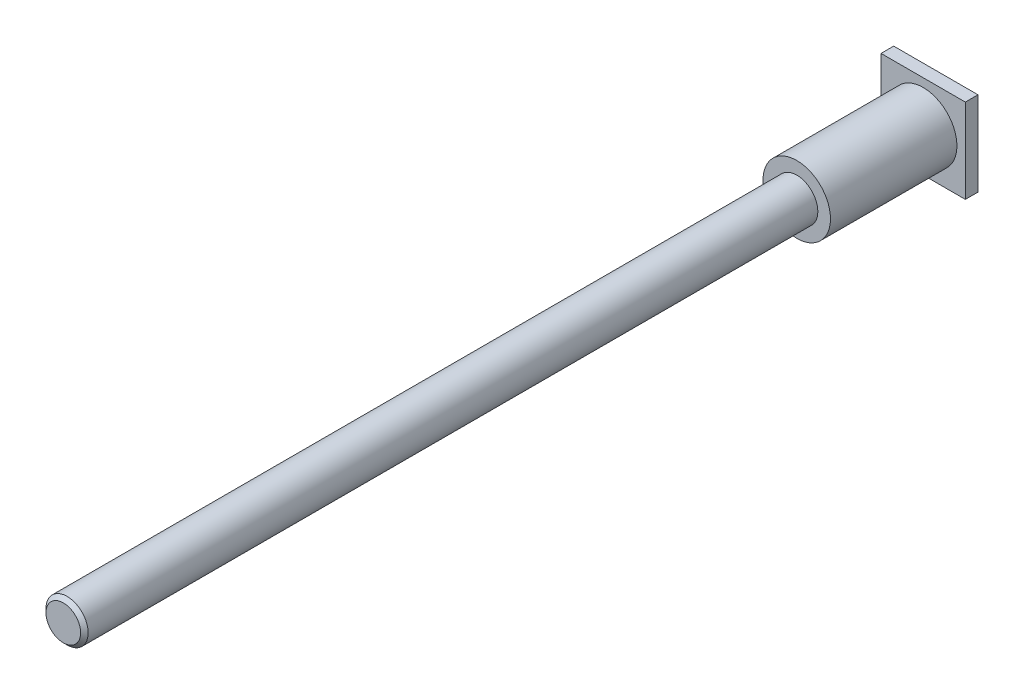
ISO-10303-21;
HEADER;
FILE_DESCRIPTION(('STEP AP214'),'2;1');
FILE_NAME('part.step','',(''),(''),'','','');
FILE_SCHEMA(('AUTOMOTIVE_DESIGN { 1 0 10303 214 1 1 1 1 }'));
ENDSEC;
DATA;
#1=APPLICATION_CONTEXT('core data for automotive mechanical design processes');
#2=APPLICATION_PROTOCOL_DEFINITION('international standard','automotive_design',2000,#1);
#3=PRODUCT_CONTEXT('',#1,'mechanical');
#4=PRODUCT('Part','Part','',(#3));
#5=PRODUCT_RELATED_PRODUCT_CATEGORY('part','',(#4));
#6=PRODUCT_DEFINITION_FORMATION('','',#4);
#7=PRODUCT_DEFINITION_CONTEXT('part definition',#1,'design');
#8=PRODUCT_DEFINITION('design','',#6,#7);
#9=PRODUCT_DEFINITION_SHAPE('','',#8);
#10=(LENGTH_UNIT() NAMED_UNIT(*) SI_UNIT(.MILLI.,.METRE.));
#11=(NAMED_UNIT(*) PLANE_ANGLE_UNIT() SI_UNIT($,.RADIAN.));
#12=(NAMED_UNIT(*) SI_UNIT($,.STERADIAN.) SOLID_ANGLE_UNIT());
#13=UNCERTAINTY_MEASURE_WITH_UNIT(LENGTH_MEASURE(1.E-05),#10,'distance_accuracy_value','');
#14=(GEOMETRIC_REPRESENTATION_CONTEXT(3) GLOBAL_UNCERTAINTY_ASSIGNED_CONTEXT((#13)) GLOBAL_UNIT_ASSIGNED_CONTEXT((#10,
#11,#12)) REPRESENTATION_CONTEXT('',''));
#15=CARTESIAN_POINT('',(0.,0.,0.));
#16=DIRECTION('',(0.,0.,1.));
#17=DIRECTION('',(1.,0.,0.));
#18=AXIS2_PLACEMENT_3D('',#15,#16,#17);
#19=CARTESIAN_POINT('',(0.,0.,102.));
#20=DIRECTION('',(0.,0.,-1.));
#21=DIRECTION('',(-1.,0.,0.));
#22=AXIS2_PLACEMENT_3D('',#19,#20,#21);
#23=CYLINDRICAL_SURFACE('',#22,4.);
#24=CARTESIAN_POINT('',(0.,0.,0.));
#25=DIRECTION('',(0.,0.,-1.));
#26=DIRECTION('',(-1.,0.,0.));
#27=AXIS2_PLACEMENT_3D('',#24,#25,#26);
#28=CIRCLE('',#27,4.);
#29=CARTESIAN_POINT('',(-4.,0.,0.));
#30=VERTEX_POINT('',#29);
#31=EDGE_CURVE('E129',#30,#30,#28,.T.);
#32=ORIENTED_EDGE('',*,*,#31,.F.);
#33=EDGE_LOOP('',(#32));
#34=FACE_BOUND('',#33,.T.);
#35=CARTESIAN_POINT('',(0.,0.,15.));
#36=DIRECTION('',(0.,0.,1.));
#37=DIRECTION('',(1.,0.,0.));
#38=AXIS2_PLACEMENT_3D('',#35,#36,#37);
#39=CIRCLE('',#38,4.);
#40=CARTESIAN_POINT('',(4.,0.,15.));
#41=VERTEX_POINT('',#40);
#42=EDGE_CURVE('E102',#41,#41,#39,.T.);
#43=ORIENTED_EDGE('',*,*,#42,.F.);
#44=EDGE_LOOP('',(#43));
#45=FACE_BOUND('',#44,.T.);
#46=ADVANCED_FACE('F38',(#34,#45),#23,.T.);
#47=CARTESIAN_POINT('',(0.,0.,0.));
#48=DIRECTION('',(0.,0.,-1.));
#49=DIRECTION('',(-1.,0.,0.));
#50=AXIS2_PLACEMENT_3D('',#47,#48,#49);
#51=PLANE('',#50);
#52=DIRECTION('',(0.,-1.,0.));
#53=VECTOR('',#52,1.);
#54=CARTESIAN_POINT('',(5.,-5.,0.));
#55=LINE('',#54,#53);
#56=CARTESIAN_POINT('',(5.,5.,0.));
#57=VERTEX_POINT('',#56);
#58=CARTESIAN_POINT('',(5.,-5.,0.));
#59=VERTEX_POINT('',#58);
#60=EDGE_CURVE('E101',#57,#59,#55,.T.);
#61=ORIENTED_EDGE('',*,*,#60,.F.);
#62=DIRECTION('',(1.,0.,0.));
#63=VECTOR('',#62,1.);
#64=CARTESIAN_POINT('',(-5.,5.,0.));
#65=LINE('',#64,#63);
#66=CARTESIAN_POINT('',(-5.,5.,0.));
#67=VERTEX_POINT('',#66);
#68=EDGE_CURVE('E79',#67,#57,#65,.T.);
#69=ORIENTED_EDGE('',*,*,#68,.F.);
#70=DIRECTION('',(0.,1.,0.));
#71=VECTOR('',#70,1.);
#72=CARTESIAN_POINT('',(-5.,-5.,0.));
#73=LINE('',#72,#71);
#74=CARTESIAN_POINT('',(-5.,-5.,0.));
#75=VERTEX_POINT('',#74);
#76=EDGE_CURVE('E73',#75,#67,#73,.T.);
#77=ORIENTED_EDGE('',*,*,#76,.F.);
#78=DIRECTION('',(-1.,0.,0.));
#79=VECTOR('',#78,1.);
#80=CARTESIAN_POINT('',(-5.,-5.,0.));
#81=LINE('',#80,#79);
#82=EDGE_CURVE('E105',#59,#75,#81,.T.);
#83=ORIENTED_EDGE('',*,*,#82,.F.);
#84=EDGE_LOOP('',(#61,#69,#77,#83));
#85=FACE_BOUND('',#84,.T.);
#86=ORIENTED_EDGE('',*,*,#31,.T.);
#87=EDGE_LOOP('',(#86));
#88=FACE_BOUND('',#87,.T.);
#89=ADVANCED_FACE('F151',(#85,#88),#51,.F.);
#90=CARTESIAN_POINT('',(5.,-5.,-1.5));
#91=DIRECTION('',(-1.,0.,0.));
#92=DIRECTION('',(0.,0.,1.));
#93=AXIS2_PLACEMENT_3D('',#90,#91,#92);
#94=PLANE('',#93);
#95=ORIENTED_EDGE('',*,*,#60,.T.);
#96=DIRECTION('',(0.,0.,1.));
#97=VECTOR('',#96,1.);
#98=CARTESIAN_POINT('',(5.,-5.,-1.5));
#99=LINE('',#98,#97);
#100=CARTESIAN_POINT('',(5.,-5.,-1.5));
#101=VERTEX_POINT('',#100);
#102=EDGE_CURVE('E127',#101,#59,#99,.T.);
#103=ORIENTED_EDGE('',*,*,#102,.F.);
#104=DIRECTION('',(0.,-1.,0.));
#105=VECTOR('',#104,1.);
#106=CARTESIAN_POINT('',(5.,-5.,-1.5));
#107=LINE('',#106,#105);
#108=CARTESIAN_POINT('',(5.,5.,-1.5));
#109=VERTEX_POINT('',#108);
#110=EDGE_CURVE('E112',#109,#101,#107,.T.);
#111=ORIENTED_EDGE('',*,*,#110,.F.);
#112=DIRECTION('',(0.,0.,1.));
#113=VECTOR('',#112,1.);
#114=CARTESIAN_POINT('',(5.,5.,-1.5));
#115=LINE('',#114,#113);
#116=EDGE_CURVE('E117',#109,#57,#115,.T.);
#117=ORIENTED_EDGE('',*,*,#116,.T.);
#118=EDGE_LOOP('',(#95,#103,#111,#117));
#119=FACE_BOUND('',#118,.T.);
#120=ADVANCED_FACE('F157',(#119),#94,.F.);
#121=CARTESIAN_POINT('',(-5.,-5.,-1.5));
#122=DIRECTION('',(0.,1.,0.));
#123=DIRECTION('',(-1.,0.,0.));
#124=AXIS2_PLACEMENT_3D('',#121,#122,#123);
#125=PLANE('',#124);
#126=ORIENTED_EDGE('',*,*,#82,.T.);
#127=DIRECTION('',(0.,0.,1.));
#128=VECTOR('',#127,1.);
#129=CARTESIAN_POINT('',(-5.,-5.,-1.5));
#130=LINE('',#129,#128);
#131=CARTESIAN_POINT('',(-5.,-5.,-1.5));
#132=VERTEX_POINT('',#131);
#133=EDGE_CURVE('E125',#132,#75,#130,.T.);
#134=ORIENTED_EDGE('',*,*,#133,.F.);
#135=DIRECTION('',(-1.,0.,0.));
#136=VECTOR('',#135,1.);
#137=CARTESIAN_POINT('',(-5.,-5.,-1.5));
#138=LINE('',#137,#136);
#139=EDGE_CURVE('E87',#101,#132,#138,.T.);
#140=ORIENTED_EDGE('',*,*,#139,.F.);
#141=ORIENTED_EDGE('',*,*,#102,.T.);
#142=EDGE_LOOP('',(#126,#134,#140,#141));
#143=FACE_BOUND('',#142,.T.);
#144=ADVANCED_FACE('F190',(#143),#125,.F.);
#145=CARTESIAN_POINT('',(-5.,-5.,-1.5));
#146=DIRECTION('',(1.,0.,0.));
#147=DIRECTION('',(0.,1.,0.));
#148=AXIS2_PLACEMENT_3D('',#145,#146,#147);
#149=PLANE('',#148);
#150=ORIENTED_EDGE('',*,*,#76,.T.);
#151=DIRECTION('',(0.,0.,1.));
#152=VECTOR('',#151,1.);
#153=CARTESIAN_POINT('',(-5.,5.,-1.5));
#154=LINE('',#153,#152);
#155=CARTESIAN_POINT('',(-5.,5.,-1.5));
#156=VERTEX_POINT('',#155);
#157=EDGE_CURVE('E123',#156,#67,#154,.T.);
#158=ORIENTED_EDGE('',*,*,#157,.F.);
#159=DIRECTION('',(0.,1.,0.));
#160=VECTOR('',#159,1.);
#161=CARTESIAN_POINT('',(-5.,-5.,-1.5));
#162=LINE('',#161,#160);
#163=EDGE_CURVE('E115',#132,#156,#162,.T.);
#164=ORIENTED_EDGE('',*,*,#163,.F.);
#165=ORIENTED_EDGE('',*,*,#133,.T.);
#166=EDGE_LOOP('',(#150,#158,#164,#165));
#167=FACE_BOUND('',#166,.T.);
#168=ADVANCED_FACE('F187',(#167),#149,.F.);
#169=CARTESIAN_POINT('',(-5.,5.,-1.5));
#170=DIRECTION('',(0.,-1.,0.));
#171=DIRECTION('',(1.,0.,0.));
#172=AXIS2_PLACEMENT_3D('',#169,#170,#171);
#173=PLANE('',#172);
#174=ORIENTED_EDGE('',*,*,#68,.T.);
#175=ORIENTED_EDGE('',*,*,#116,.F.);
#176=DIRECTION('',(1.,0.,0.));
#177=VECTOR('',#176,1.);
#178=CARTESIAN_POINT('',(-5.,5.,-1.5));
#179=LINE('',#178,#177);
#180=EDGE_CURVE('E55',#156,#109,#179,.T.);
#181=ORIENTED_EDGE('',*,*,#180,.F.);
#182=ORIENTED_EDGE('',*,*,#157,.T.);
#183=EDGE_LOOP('',(#174,#175,#181,#182));
#184=FACE_BOUND('',#183,.T.);
#185=ADVANCED_FACE('F181',(#184),#173,.F.);
#186=CARTESIAN_POINT('',(0.,0.,-1.5));
#187=DIRECTION('',(0.,0.,-1.));
#188=DIRECTION('',(-1.,0.,0.));
#189=AXIS2_PLACEMENT_3D('',#186,#187,#188);
#190=PLANE('',#189);
#191=CARTESIAN_POINT('',(0.,0.,-1.5));
#192=DIRECTION('',(0.,0.,-1.));
#193=DIRECTION('',(-1.,0.,0.));
#194=AXIS2_PLACEMENT_3D('',#191,#192,#193);
#195=CIRCLE('',#194,2.49999999999999);
#196=CARTESIAN_POINT('',(-2.5,0.,-1.5));
#197=VERTEX_POINT('',#196);
#198=EDGE_CURVE('E135',#197,#197,#195,.F.);
#199=ORIENTED_EDGE('',*,*,#198,.T.);
#200=EDGE_LOOP('',(#199));
#201=FACE_BOUND('',#200,.T.);
#202=ORIENTED_EDGE('',*,*,#110,.T.);
#203=ORIENTED_EDGE('',*,*,#139,.T.);
#204=ORIENTED_EDGE('',*,*,#163,.T.);
#205=ORIENTED_EDGE('',*,*,#180,.T.);
#206=EDGE_LOOP('',(#202,#203,#204,#205));
#207=FACE_BOUND('',#206,.T.);
#208=ADVANCED_FACE('F176',(#201,#207),#190,.T.);
#209=CARTESIAN_POINT('',(0.,0.,13.5));
#210=DIRECTION('',(0.,0.,-1.));
#211=DIRECTION('',(-1.,0.,0.));
#212=AXIS2_PLACEMENT_3D('',#209,#210,#211);
#213=CYLINDRICAL_SURFACE('',#212,2.055);
#214=CARTESIAN_POINT('',(0.,0.,-1.055));
#215=DIRECTION('',(0.,0.,-1.));
#216=DIRECTION('',(-1.,0.,0.));
#217=AXIS2_PLACEMENT_3D('',#214,#215,#216);
#218=CIRCLE('',#217,2.055);
#219=CARTESIAN_POINT('',(-2.055,0.,-1.055));
#220=VERTEX_POINT('',#219);
#221=EDGE_CURVE('E132',#220,#220,#218,.T.);
#222=ORIENTED_EDGE('',*,*,#221,.T.);
#223=EDGE_LOOP('',(#222));
#224=FACE_BOUND('',#223,.T.);
#225=CARTESIAN_POINT('',(0.,0.,13.5));
#226=DIRECTION('',(0.,0.,-1.));
#227=DIRECTION('',(-1.,0.,0.));
#228=AXIS2_PLACEMENT_3D('',#225,#226,#227);
#229=CIRCLE('',#228,2.055);
#230=CARTESIAN_POINT('',(-2.055,0.,13.5));
#231=VERTEX_POINT('',#230);
#232=EDGE_CURVE('E99',#231,#231,#229,.T.);
#233=ORIENTED_EDGE('',*,*,#232,.F.);
#234=EDGE_LOOP('',(#233));
#235=FACE_BOUND('',#234,.T.);
#236=ADVANCED_FACE('F95',(#224,#235),#213,.F.);
#237=CARTESIAN_POINT('',(0.,0.,13.5));
#238=DIRECTION('',(0.,0.,-1.));
#239=DIRECTION('',(-1.,0.,0.));
#240=AXIS2_PLACEMENT_3D('',#237,#238,#239);
#241=CONICAL_SURFACE('',#240,2.055,1.0471975511966);
#242=CARTESIAN_POINT('',(0.,0.,14.6864548031847));
#243=VERTEX_POINT('',#242);
#244=VERTEX_LOOP('',#243);
#245=FACE_BOUND('',#244,.T.);
#246=ORIENTED_EDGE('',*,*,#232,.T.);
#247=EDGE_LOOP('',(#246));
#248=FACE_BOUND('',#247,.T.);
#249=ADVANCED_FACE('F91',(#245,#248),#241,.F.);
#250=CARTESIAN_POINT('',(0.,0.,-1.055));
#251=DIRECTION('',(0.,0.,-1.));
#252=DIRECTION('',(-1.,0.,0.));
#253=AXIS2_PLACEMENT_3D('',#250,#251,#252);
#254=CONICAL_SURFACE('',#253,2.055,0.785398163397442);
#255=CARTESIAN_POINT('',(-2.5,0.,-1.5));
#256=CARTESIAN_POINT('',(-2.49536458333333,0.,-1.49536458333333));
#257=CARTESIAN_POINT('',(-2.49072916666666,0.,-1.49072916666667));
#258=CARTESIAN_POINT('',(-2.48145833333333,0.,-1.48145833333333));
#259=CARTESIAN_POINT('',(-2.47682291666666,0.,-1.47682291666667));
#260=CARTESIAN_POINT('',(-2.46755208333333,0.,-1.46755208333333));
#261=CARTESIAN_POINT('',(-2.46291666666666,0.,-1.46291666666667));
#262=CARTESIAN_POINT('',(-2.45364583333333,0.,-1.45364583333333));
#263=CARTESIAN_POINT('',(-2.44901041666666,0.,-1.44901041666667));
#264=CARTESIAN_POINT('',(-2.43973958333333,0.,-1.43973958333333));
#265=CARTESIAN_POINT('',(-2.43510416666666,0.,-1.43510416666667));
#266=CARTESIAN_POINT('',(-2.42583333333333,0.,-1.42583333333333));
#267=CARTESIAN_POINT('',(-2.42119791666666,0.,-1.42119791666667));
#268=CARTESIAN_POINT('',(-2.41192708333333,0.,-1.41192708333333));
#269=CARTESIAN_POINT('',(-2.40729166666666,0.,-1.40729166666667));
#270=CARTESIAN_POINT('',(-2.39802083333333,0.,-1.39802083333333));
#271=CARTESIAN_POINT('',(-2.39338541666666,0.,-1.39338541666667));
#272=CARTESIAN_POINT('',(-2.38411458333333,0.,-1.38411458333333));
#273=CARTESIAN_POINT('',(-2.37947916666666,0.,-1.37947916666667));
#274=CARTESIAN_POINT('',(-2.37020833333333,0.,-1.37020833333333));
#275=CARTESIAN_POINT('',(-2.36557291666666,0.,-1.36557291666667));
#276=CARTESIAN_POINT('',(-2.35630208333333,0.,-1.35630208333333));
#277=CARTESIAN_POINT('',(-2.35166666666666,0.,-1.35166666666667));
#278=CARTESIAN_POINT('',(-2.34239583333333,0.,-1.34239583333333));
#279=CARTESIAN_POINT('',(-2.33776041666666,0.,-1.33776041666667));
#280=CARTESIAN_POINT('',(-2.32848958333333,0.,-1.32848958333333));
#281=CARTESIAN_POINT('',(-2.32385416666666,0.,-1.32385416666667));
#282=CARTESIAN_POINT('',(-2.31458333333333,0.,-1.31458333333333));
#283=CARTESIAN_POINT('',(-2.30994791666666,0.,-1.30994791666667));
#284=CARTESIAN_POINT('',(-2.30067708333333,0.,-1.30067708333333));
#285=CARTESIAN_POINT('',(-2.29604166666666,0.,-1.29604166666667));
#286=CARTESIAN_POINT('',(-2.28677083333333,0.,-1.28677083333333));
#287=CARTESIAN_POINT('',(-2.28213541666666,0.,-1.28213541666667));
#288=CARTESIAN_POINT('',(-2.27286458333333,0.,-1.27286458333333));
#289=CARTESIAN_POINT('',(-2.26822916666666,0.,-1.26822916666667));
#290=CARTESIAN_POINT('',(-2.25895833333333,0.,-1.25895833333333));
#291=CARTESIAN_POINT('',(-2.25432291666666,0.,-1.25432291666667));
#292=CARTESIAN_POINT('',(-2.24505208333333,0.,-1.24505208333333));
#293=CARTESIAN_POINT('',(-2.24041666666666,0.,-1.24041666666667));
#294=CARTESIAN_POINT('',(-2.23114583333333,0.,-1.23114583333333));
#295=CARTESIAN_POINT('',(-2.22651041666667,0.,-1.22651041666667));
#296=CARTESIAN_POINT('',(-2.21723958333333,0.,-1.21723958333333));
#297=CARTESIAN_POINT('',(-2.21260416666667,0.,-1.21260416666667));
#298=CARTESIAN_POINT('',(-2.20333333333333,0.,-1.20333333333333));
#299=CARTESIAN_POINT('',(-2.19869791666667,0.,-1.19869791666667));
#300=CARTESIAN_POINT('',(-2.18942708333333,0.,-1.18942708333333));
#301=CARTESIAN_POINT('',(-2.18479166666667,0.,-1.18479166666667));
#302=CARTESIAN_POINT('',(-2.17552083333333,0.,-1.17552083333333));
#303=CARTESIAN_POINT('',(-2.17088541666667,0.,-1.17088541666667));
#304=CARTESIAN_POINT('',(-2.16161458333333,0.,-1.16161458333333));
#305=CARTESIAN_POINT('',(-2.15697916666667,0.,-1.15697916666667));
#306=CARTESIAN_POINT('',(-2.14770833333333,0.,-1.14770833333333));
#307=CARTESIAN_POINT('',(-2.14307291666667,0.,-1.14307291666667));
#308=CARTESIAN_POINT('',(-2.13380208333333,0.,-1.13380208333333));
#309=CARTESIAN_POINT('',(-2.12916666666667,0.,-1.12916666666667));
#310=CARTESIAN_POINT('',(-2.11989583333333,0.,-1.11989583333333));
#311=CARTESIAN_POINT('',(-2.11526041666667,0.,-1.11526041666667));
#312=CARTESIAN_POINT('',(-2.10598958333333,0.,-1.10598958333333));
#313=CARTESIAN_POINT('',(-2.10135416666667,0.,-1.10135416666667));
#314=CARTESIAN_POINT('',(-2.09208333333333,0.,-1.09208333333333));
#315=CARTESIAN_POINT('',(-2.08744791666667,0.,-1.08744791666667));
#316=CARTESIAN_POINT('',(-2.07817708333333,0.,-1.07817708333333));
#317=CARTESIAN_POINT('',(-2.07354166666667,0.,-1.07354166666667));
#318=CARTESIAN_POINT('',(-2.06427083333333,0.,-1.06427083333333));
#319=CARTESIAN_POINT('',(-2.05963541666667,0.,-1.05963541666667));
#320=CARTESIAN_POINT('',(-2.055,0.,-1.055));
#321=B_SPLINE_CURVE_WITH_KNOTS('',3,(#255,#256,#257,#258,#259,#260,#261,#262,#263,#264,#265,
#266,#267,#268,#269,#270,#271,#272,#273,#274,#275,#276,#277,#278,#279,#280,#281,#282,#283,#284,
#285,#286,#287,#288,#289,#290,#291,#292,#293,#294,#295,#296,#297,#298,#299,#300,#301,#302,#303,
#304,#305,#306,#307,#308,#309,#310,#311,#312,#313,#314,#315,#316,#317,#318,#319,#320),
.UNSPECIFIED.,.F.,.F.,(4,2,2,2,2,2,2,2,2,2,2,2,2,2,2,2,2,2,2,2,2,2,2,2,2,2,2,2,2,2,2,2,4),(0.,
0.0196664073517509,0.0393328147035015,0.0589992220552524,0.078665629407003,0.0983320367587539,
0.117998444110505,0.137664851462255,0.157331258814006,0.176997666165757,0.196664073517508,
0.216330480869258,0.235996888221009,0.25566329557276,0.275329702924511,0.294996110276262,
0.314662517628012,0.334328924979763,0.353995332331514,0.373661739683265,0.393328147035015,
0.412994554386766,0.432660961738517,0.452327369090268,0.471993776442019,0.491660183793769,
0.51132659114552,0.530992998497271,0.550659405849022,0.570325813200772,0.589992220552523,
0.609658627904274,0.629325035256024),.UNSPECIFIED.);
#322=EDGE_CURVE('BSEAM94',#197,#220,#321,.T.);
#323=ORIENTED_EDGE('',*,*,#198,.F.);
#324=ORIENTED_EDGE('',*,*,#221,.F.);
#325=ORIENTED_EDGE('',*,*,#322,.T.);
#326=ORIENTED_EDGE('',*,*,#322,.F.);
#327=EDGE_LOOP('',(#323,#325,#324,#326));
#328=FACE_BOUND('',#327,.T.);
#329=ADVANCED_FACE('F94',(#328),#254,.F.);
#330=CARTESIAN_POINT('',(0.,0.,15.));
#331=DIRECTION('',(0.,0.,1.));
#332=DIRECTION('',(1.,0.,0.));
#333=AXIS2_PLACEMENT_3D('',#330,#331,#332);
#334=PLANE('',#333);
#335=CARTESIAN_POINT('',(0.,0.,15.));
#336=DIRECTION('',(0.,0.,1.));
#337=DIRECTION('',(1.,0.,0.));
#338=AXIS2_PLACEMENT_3D('',#335,#336,#337);
#339=CIRCLE('',#338,2.5);
#340=CARTESIAN_POINT('',(2.5,0.,15.));
#341=VERTEX_POINT('',#340);
#342=EDGE_CURVE('E108',#341,#341,#339,.T.);
#343=ORIENTED_EDGE('',*,*,#342,.F.);
#344=EDGE_LOOP('',(#343));
#345=FACE_BOUND('',#344,.T.);
#346=ORIENTED_EDGE('',*,*,#42,.T.);
#347=EDGE_LOOP('',(#346));
#348=FACE_BOUND('',#347,.T.);
#349=ADVANCED_FACE('F164',(#345,#348),#334,.T.);
#350=CARTESIAN_POINT('',(0.,0.,102.));
#351=DIRECTION('',(0.,0.,-1.));
#352=DIRECTION('',(-1.,0.,0.));
#353=AXIS2_PLACEMENT_3D('',#350,#351,#352);
#354=CYLINDRICAL_SURFACE('',#353,2.5);
#355=CARTESIAN_POINT('',(0.,0.,101.555));
#356=DIRECTION('',(0.,0.,1.));
#357=DIRECTION('',(1.,0.,0.));
#358=AXIS2_PLACEMENT_3D('',#355,#356,#357);
#359=CIRCLE('',#358,2.5);
#360=CARTESIAN_POINT('',(2.5,0.,101.555));
#361=VERTEX_POINT('',#360);
#362=EDGE_CURVE('E11',#361,#361,#359,.F.);
#363=ORIENTED_EDGE('',*,*,#362,.T.);
#364=EDGE_LOOP('',(#363));
#365=FACE_BOUND('',#364,.T.);
#366=ORIENTED_EDGE('',*,*,#342,.T.);
#367=EDGE_LOOP('',(#366));
#368=FACE_BOUND('',#367,.T.);
#369=ADVANCED_FACE('F147',(#365,#368),#354,.T.);
#370=CARTESIAN_POINT('',(0.,0.,102.));
#371=DIRECTION('',(0.,0.,1.));
#372=DIRECTION('',(1.,0.,0.));
#373=AXIS2_PLACEMENT_3D('',#370,#371,#372);
#374=PLANE('',#373);
#375=CARTESIAN_POINT('',(0.,0.,102.));
#376=DIRECTION('',(0.,0.,1.));
#377=DIRECTION('',(1.,0.,0.));
#378=AXIS2_PLACEMENT_3D('',#375,#376,#377);
#379=CIRCLE('',#378,2.05499999999999);
#380=CARTESIAN_POINT('',(2.05499999999999,0.,102.));
#381=VERTEX_POINT('',#380);
#382=EDGE_CURVE('E47',#381,#381,#379,.T.);
#383=ORIENTED_EDGE('',*,*,#382,.T.);
#384=EDGE_LOOP('',(#383));
#385=FACE_BOUND('',#384,.T.);
#386=ADVANCED_FACE('F140',(#385),#374,.T.);
#387=CARTESIAN_POINT('',(0.,0.,102.));
#388=DIRECTION('',(0.,0.,-1.));
#389=DIRECTION('',(-1.,0.,0.));
#390=AXIS2_PLACEMENT_3D('',#387,#388,#389);
#391=CONICAL_SURFACE('',#390,2.05499999999999,0.785398163397446);
#392=ORIENTED_EDGE('',*,*,#362,.F.);
#393=EDGE_LOOP('',(#392));
#394=FACE_BOUND('',#393,.T.);
#395=ORIENTED_EDGE('',*,*,#382,.F.);
#396=EDGE_LOOP('',(#395));
#397=FACE_BOUND('',#396,.T.);
#398=ADVANCED_FACE('F40',(#394,#397),#391,.T.);
#399=CLOSED_SHELL('',(#46,#89,#120,#144,#168,#185,#208,#236,#249,#329,#349,#369,#386,#398));
#400=MANIFOLD_SOLID_BREP('B2',#399);
#401=ADVANCED_BREP_SHAPE_REPRESENTATION('',(#18,#400),#14);
#402=SHAPE_DEFINITION_REPRESENTATION(#9,#401);
ENDSEC;
END-ISO-10303-21;
